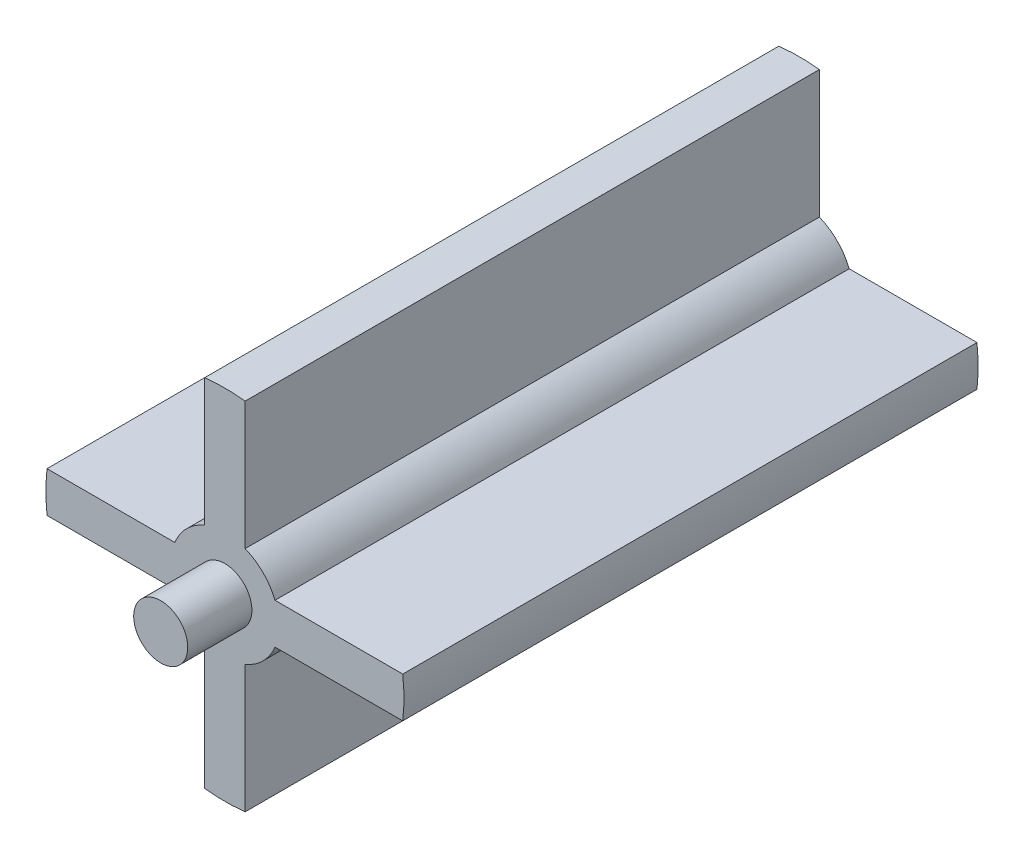
ISO-10303-21;
HEADER;
FILE_DESCRIPTION(('STEP AP214'),'2;1');
FILE_NAME('part.step','',(''),(''),'','','');
FILE_SCHEMA(('AUTOMOTIVE_DESIGN { 1 0 10303 214 1 1 1 1 }'));
ENDSEC;
DATA;
#1=APPLICATION_CONTEXT('core data for automotive mechanical design processes');
#2=APPLICATION_PROTOCOL_DEFINITION('international standard','automotive_design',2000,#1);
#3=PRODUCT_CONTEXT('',#1,'mechanical');
#4=PRODUCT('Part','Part','',(#3));
#5=PRODUCT_RELATED_PRODUCT_CATEGORY('part','',(#4));
#6=PRODUCT_DEFINITION_FORMATION('','',#4);
#7=PRODUCT_DEFINITION_CONTEXT('part definition',#1,'design');
#8=PRODUCT_DEFINITION('design','',#6,#7);
#9=PRODUCT_DEFINITION_SHAPE('','',#8);
#10=(LENGTH_UNIT() NAMED_UNIT(*) SI_UNIT(.MILLI.,.METRE.));
#11=(NAMED_UNIT(*) PLANE_ANGLE_UNIT() SI_UNIT($,.RADIAN.));
#12=(NAMED_UNIT(*) SI_UNIT($,.STERADIAN.) SOLID_ANGLE_UNIT());
#13=UNCERTAINTY_MEASURE_WITH_UNIT(LENGTH_MEASURE(1.E-05),#10,'distance_accuracy_value','');
#14=(GEOMETRIC_REPRESENTATION_CONTEXT(3) GLOBAL_UNCERTAINTY_ASSIGNED_CONTEXT((#13)) GLOBAL_UNIT_ASSIGNED_CONTEXT((#10,
#11,#12)) REPRESENTATION_CONTEXT('',''));
#15=CARTESIAN_POINT('',(0.,0.,0.));
#16=DIRECTION('',(0.,0.,1.));
#17=DIRECTION('',(1.,0.,0.));
#18=AXIS2_PLACEMENT_3D('',#15,#16,#17);
#19=CARTESIAN_POINT('',(9.53294491023637,-9.21867200110799,14.5));
#20=DIRECTION('',(0.,0.,-1.));
#21=DIRECTION('',(-1.,0.,0.));
#22=AXIS2_PLACEMENT_3D('',#19,#20,#21);
#23=CYLINDRICAL_SURFACE('',#22,3.975);
#24=CARTESIAN_POINT('',(9.53294491023637,-9.21867200110799,14.5));
#25=DIRECTION('',(0.,0.,1.));
#26=DIRECTION('',(1.,0.,0.));
#27=AXIS2_PLACEMENT_3D('',#24,#25,#26);
#28=CIRCLE('',#27,3.975);
#29=CARTESIAN_POINT('',(13.5079449102364,-9.21867200110799,14.5));
#30=VERTEX_POINT('',#29);
#31=EDGE_CURVE('E12',#30,#30,#28,.T.);
#32=ORIENTED_EDGE('',*,*,#31,.F.);
#33=EDGE_LOOP('',(#32));
#34=FACE_BOUND('',#33,.T.);
#35=CARTESIAN_POINT('',(9.53294491023637,-9.21867200110799,0.));
#36=DIRECTION('',(0.,0.,1.));
#37=DIRECTION('',(1.,0.,0.));
#38=AXIS2_PLACEMENT_3D('',#35,#36,#37);
#39=CIRCLE('',#38,3.975);
#40=CARTESIAN_POINT('',(13.5079449102364,-9.21867200110799,0.));
#41=VERTEX_POINT('',#40);
#42=EDGE_CURVE('E47',#41,#41,#39,.T.);
#43=ORIENTED_EDGE('',*,*,#42,.T.);
#44=EDGE_LOOP('',(#43));
#45=FACE_BOUND('',#44,.T.);
#46=ADVANCED_FACE('F44',(#34,#45),#23,.T.);
#47=CARTESIAN_POINT('',(9.53294491023637,-9.21867200110799,14.5));
#48=DIRECTION('',(0.,0.,1.));
#49=DIRECTION('',(1.,0.,0.));
#50=AXIS2_PLACEMENT_3D('',#47,#48,#49);
#51=PLANE('',#50);
#52=ORIENTED_EDGE('',*,*,#31,.T.);
#53=EDGE_LOOP('',(#52));
#54=FACE_BOUND('',#53,.T.);
#55=ADVANCED_FACE('F59',(#54),#51,.T.);
#56=CARTESIAN_POINT('',(9.53294491023637,-9.21867200110799,0.));
#57=DIRECTION('',(0.,0.,1.));
#58=DIRECTION('',(1.,0.,0.));
#59=AXIS2_PLACEMENT_3D('',#56,#57,#58);
#60=PLANE('',#59);
#61=ORIENTED_EDGE('',*,*,#42,.F.);
#62=EDGE_LOOP('',(#61));
#63=FACE_BOUND('',#62,.T.);
#64=ADVANCED_FACE('F57',(#63),#60,.F.);
#65=CLOSED_SHELL('',(#46,#55,#64));
#66=MANIFOLD_SOLID_BREP('B2',#65);
#67=CARTESIAN_POINT('',(0.,0.,85.));
#68=DIRECTION('',(0.,0.,-1.));
#69=DIRECTION('',(-1.,0.,0.));
#70=AXIS2_PLACEMENT_3D('',#67,#68,#69);
#71=CYLINDRICAL_SURFACE('',#70,26.5);
#72=DIRECTION('',(0.,0.,-1.));
#73=VECTOR('',#72,1.);
#74=CARTESIAN_POINT('',(26.3296410913632,3.,85.));
#75=LINE('',#74,#73);
#76=CARTESIAN_POINT('',(26.3296410913632,3.,85.));
#77=VERTEX_POINT('',#76);
#78=CARTESIAN_POINT('',(26.3296410913632,3.,0.));
#79=VERTEX_POINT('',#78);
#80=EDGE_CURVE('E225',#77,#79,#75,.T.);
#81=ORIENTED_EDGE('',*,*,#80,.F.);
#82=CARTESIAN_POINT('',(0.,0.,85.));
#83=DIRECTION('',(0.,0.,1.));
#84=DIRECTION('',(1.,0.,0.));
#85=AXIS2_PLACEMENT_3D('',#82,#83,#84);
#86=CIRCLE('',#85,26.5);
#87=CARTESIAN_POINT('',(26.3296410913632,-3.,85.));
#88=VERTEX_POINT('',#87);
#89=EDGE_CURVE('E218',#88,#77,#86,.T.);
#90=ORIENTED_EDGE('',*,*,#89,.F.);
#91=DIRECTION('',(0.,0.,-1.));
#92=VECTOR('',#91,1.);
#93=CARTESIAN_POINT('',(26.3296410913632,-3.,85.));
#94=LINE('',#93,#92);
#95=CARTESIAN_POINT('',(26.3296410913632,-3.,0.));
#96=VERTEX_POINT('',#95);
#97=EDGE_CURVE('E199',#88,#96,#94,.T.);
#98=ORIENTED_EDGE('',*,*,#97,.T.);
#99=CARTESIAN_POINT('',(0.,0.,0.));
#100=DIRECTION('',(0.,0.,1.));
#101=DIRECTION('',(1.,0.,0.));
#102=AXIS2_PLACEMENT_3D('',#99,#100,#101);
#103=CIRCLE('',#102,26.5);
#104=EDGE_CURVE('E88',#96,#79,#103,.T.);
#105=ORIENTED_EDGE('',*,*,#104,.T.);
#106=EDGE_LOOP('',(#81,#90,#98,#105));
#107=FACE_BOUND('',#106,.T.);
#108=ADVANCED_FACE('F85',(#107),#71,.T.);
#109=DIRECTION('',(0.,0.,-1.));
#110=VECTOR('',#109,1.);
#111=CARTESIAN_POINT('',(3.,26.3296410913632,85.));
#112=LINE('',#111,#110);
#113=CARTESIAN_POINT('',(3.,26.3296410913632,85.));
#114=VERTEX_POINT('',#113);
#115=CARTESIAN_POINT('',(3.,26.3296410913632,0.));
#116=VERTEX_POINT('',#115);
#117=EDGE_CURVE('E292',#114,#116,#112,.T.);
#118=ORIENTED_EDGE('',*,*,#117,.T.);
#119=CARTESIAN_POINT('',(-3.,26.3296410913632,0.));
#120=VERTEX_POINT('',#119);
#121=EDGE_CURVE('E227',#116,#120,#103,.T.);
#122=ORIENTED_EDGE('',*,*,#121,.T.);
#123=DIRECTION('',(0.,0.,-1.));
#124=VECTOR('',#123,1.);
#125=CARTESIAN_POINT('',(-3.,26.3296410913632,85.));
#126=LINE('',#125,#124);
#127=CARTESIAN_POINT('',(-3.,26.3296410913632,85.));
#128=VERTEX_POINT('',#127);
#129=EDGE_CURVE('E295',#128,#120,#126,.T.);
#130=ORIENTED_EDGE('',*,*,#129,.F.);
#131=EDGE_CURVE('E93',#114,#128,#86,.T.);
#132=ORIENTED_EDGE('',*,*,#131,.F.);
#133=EDGE_LOOP('',(#118,#122,#130,#132));
#134=FACE_BOUND('',#133,.T.);
#135=ADVANCED_FACE('F382',(#134),#71,.T.);
#136=DIRECTION('',(0.,0.,-1.));
#137=VECTOR('',#136,1.);
#138=CARTESIAN_POINT('',(-26.3296410913632,3.,85.));
#139=LINE('',#138,#137);
#140=CARTESIAN_POINT('',(-26.3296410913632,3.,85.));
#141=VERTEX_POINT('',#140);
#142=CARTESIAN_POINT('',(-26.3296410913632,3.,0.));
#143=VERTEX_POINT('',#142);
#144=EDGE_CURVE('E251',#141,#143,#139,.T.);
#145=ORIENTED_EDGE('',*,*,#144,.T.);
#146=CARTESIAN_POINT('',(-26.3296410913632,-3.,0.));
#147=VERTEX_POINT('',#146);
#148=EDGE_CURVE('E231',#143,#147,#103,.T.);
#149=ORIENTED_EDGE('',*,*,#148,.T.);
#150=DIRECTION('',(0.,0.,-1.));
#151=VECTOR('',#150,1.);
#152=CARTESIAN_POINT('',(-26.3296410913632,-3.,85.));
#153=LINE('',#152,#151);
#154=CARTESIAN_POINT('',(-26.3296410913632,-3.,85.));
#155=VERTEX_POINT('',#154);
#156=EDGE_CURVE('E253',#155,#147,#153,.T.);
#157=ORIENTED_EDGE('',*,*,#156,.F.);
#158=EDGE_CURVE('E229',#141,#155,#86,.T.);
#159=ORIENTED_EDGE('',*,*,#158,.F.);
#160=EDGE_LOOP('',(#145,#149,#157,#159));
#161=FACE_BOUND('',#160,.T.);
#162=ADVANCED_FACE('F249',(#161),#71,.T.);
#163=DIRECTION('',(0.,0.,-1.));
#164=VECTOR('',#163,1.);
#165=CARTESIAN_POINT('',(-3.,-26.3296410913632,85.));
#166=LINE('',#165,#164);
#167=CARTESIAN_POINT('',(-3.,-26.3296410913632,85.));
#168=VERTEX_POINT('',#167);
#169=CARTESIAN_POINT('',(-3.,-26.3296410913632,0.));
#170=VERTEX_POINT('',#169);
#171=EDGE_CURVE('E267',#168,#170,#166,.T.);
#172=ORIENTED_EDGE('',*,*,#171,.T.);
#173=CARTESIAN_POINT('',(2.99999999999999,-26.3296410913632,0.));
#174=VERTEX_POINT('',#173);
#175=EDGE_CURVE('E317',#170,#174,#103,.T.);
#176=ORIENTED_EDGE('',*,*,#175,.T.);
#177=DIRECTION('',(0.,0.,-1.));
#178=VECTOR('',#177,1.);
#179=CARTESIAN_POINT('',(2.99999999999999,-26.3296410913632,85.));
#180=LINE('',#179,#178);
#181=CARTESIAN_POINT('',(2.99999999999999,-26.3296410913632,85.));
#182=VERTEX_POINT('',#181);
#183=EDGE_CURVE('E270',#182,#174,#180,.T.);
#184=ORIENTED_EDGE('',*,*,#183,.F.);
#185=EDGE_CURVE('E226',#168,#182,#86,.T.);
#186=ORIENTED_EDGE('',*,*,#185,.F.);
#187=EDGE_LOOP('',(#172,#176,#184,#186));
#188=FACE_BOUND('',#187,.T.);
#189=ADVANCED_FACE('F322',(#188),#71,.T.);
#190=CARTESIAN_POINT('',(0.,0.,85.));
#191=DIRECTION('',(0.,0.,1.));
#192=DIRECTION('',(1.,0.,0.));
#193=AXIS2_PLACEMENT_3D('',#190,#191,#192);
#194=PLANE('',#193);
#195=CARTESIAN_POINT('',(0.,0.,85.));
#196=DIRECTION('',(0.,0.,1.));
#197=DIRECTION('',(1.,0.,0.));
#198=AXIS2_PLACEMENT_3D('',#195,#196,#197);
#199=CIRCLE('',#198,4.);
#200=CARTESIAN_POINT('',(4.,0.,85.));
#201=VERTEX_POINT('',#200);
#202=EDGE_CURVE('E42',#201,#201,#199,.T.);
#203=ORIENTED_EDGE('',*,*,#202,.F.);
#204=EDGE_LOOP('',(#203));
#205=FACE_BOUND('',#204,.T.);
#206=ORIENTED_EDGE('',*,*,#89,.T.);
#207=DIRECTION('',(1.,0.,0.));
#208=VECTOR('',#207,1.);
#209=CARTESIAN_POINT('',(26.3296410913632,3.,85.));
#210=LINE('',#209,#208);
#211=CARTESIAN_POINT('',(7.41619848709566,3.,85.));
#212=VERTEX_POINT('',#211);
#213=EDGE_CURVE('E212',#212,#77,#210,.T.);
#214=ORIENTED_EDGE('',*,*,#213,.F.);
#215=CARTESIAN_POINT('',(0.,0.,85.));
#216=DIRECTION('',(0.,0.,-1.));
#217=DIRECTION('',(-1.,0.,0.));
#218=AXIS2_PLACEMENT_3D('',#215,#216,#217);
#219=CIRCLE('',#218,8.);
#220=CARTESIAN_POINT('',(3.,7.41619848709566,85.));
#221=VERTEX_POINT('',#220);
#222=EDGE_CURVE('E360',#221,#212,#219,.T.);
#223=ORIENTED_EDGE('',*,*,#222,.F.);
#224=DIRECTION('',(0.,-1.,0.));
#225=VECTOR('',#224,1.);
#226=CARTESIAN_POINT('',(3.,7.41619848709566,85.));
#227=LINE('',#226,#225);
#228=EDGE_CURVE('E357',#114,#221,#227,.T.);
#229=ORIENTED_EDGE('',*,*,#228,.F.);
#230=ORIENTED_EDGE('',*,*,#131,.T.);
#231=DIRECTION('',(0.,1.,0.));
#232=VECTOR('',#231,1.);
#233=CARTESIAN_POINT('',(-3.,26.3296410913632,85.));
#234=LINE('',#233,#232);
#235=CARTESIAN_POINT('',(-3.,7.41619848709566,85.));
#236=VERTEX_POINT('',#235);
#237=EDGE_CURVE('E355',#236,#128,#234,.T.);
#238=ORIENTED_EDGE('',*,*,#237,.F.);
#239=CARTESIAN_POINT('',(0.,0.,85.));
#240=DIRECTION('',(0.,0.,-1.));
#241=DIRECTION('',(-1.,0.,0.));
#242=AXIS2_PLACEMENT_3D('',#239,#240,#241);
#243=CIRCLE('',#242,8.);
#244=CARTESIAN_POINT('',(-7.41619848709566,3.,85.));
#245=VERTEX_POINT('',#244);
#246=EDGE_CURVE('E353',#245,#236,#243,.T.);
#247=ORIENTED_EDGE('',*,*,#246,.F.);
#248=DIRECTION('',(1.,0.,0.));
#249=VECTOR('',#248,1.);
#250=CARTESIAN_POINT('',(-7.41619848709566,3.,85.));
#251=LINE('',#250,#249);
#252=EDGE_CURVE('E245',#141,#245,#251,.T.);
#253=ORIENTED_EDGE('',*,*,#252,.F.);
#254=ORIENTED_EDGE('',*,*,#158,.T.);
#255=DIRECTION('',(-1.,0.,0.));
#256=VECTOR('',#255,1.);
#257=CARTESIAN_POINT('',(-26.3296410913632,-3.,85.));
#258=LINE('',#257,#256);
#259=CARTESIAN_POINT('',(-7.41619848709566,-3.,85.));
#260=VERTEX_POINT('',#259);
#261=EDGE_CURVE('E242',#260,#155,#258,.T.);
#262=ORIENTED_EDGE('',*,*,#261,.F.);
#263=CARTESIAN_POINT('',(0.,0.,85.));
#264=DIRECTION('',(0.,0.,-1.));
#265=DIRECTION('',(-1.,0.,0.));
#266=AXIS2_PLACEMENT_3D('',#263,#264,#265);
#267=CIRCLE('',#266,8.);
#268=CARTESIAN_POINT('',(-3.,-7.41619848709566,85.));
#269=VERTEX_POINT('',#268);
#270=EDGE_CURVE('E345',#269,#260,#267,.T.);
#271=ORIENTED_EDGE('',*,*,#270,.F.);
#272=DIRECTION('',(0.,1.,0.));
#273=VECTOR('',#272,1.);
#274=CARTESIAN_POINT('',(-3.,-26.3296410913632,85.));
#275=LINE('',#274,#273);
#276=EDGE_CURVE('E344',#168,#269,#275,.T.);
#277=ORIENTED_EDGE('',*,*,#276,.F.);
#278=ORIENTED_EDGE('',*,*,#185,.T.);
#279=DIRECTION('',(0.,-1.,0.));
#280=VECTOR('',#279,1.);
#281=CARTESIAN_POINT('',(3.,-7.41619848709566,85.));
#282=LINE('',#281,#280);
#283=CARTESIAN_POINT('',(3.,-7.41619848709566,85.));
#284=VERTEX_POINT('',#283);
#285=EDGE_CURVE('E346',#284,#182,#282,.T.);
#286=ORIENTED_EDGE('',*,*,#285,.F.);
#287=CARTESIAN_POINT('',(0.,0.,85.));
#288=DIRECTION('',(0.,0.,-1.));
#289=DIRECTION('',(-1.,0.,0.));
#290=AXIS2_PLACEMENT_3D('',#287,#288,#289);
#291=CIRCLE('',#290,8.);
#292=CARTESIAN_POINT('',(7.41619848709566,-3.,85.));
#293=VERTEX_POINT('',#292);
#294=EDGE_CURVE('E221',#293,#284,#291,.T.);
#295=ORIENTED_EDGE('',*,*,#294,.F.);
#296=DIRECTION('',(-1.,0.,0.));
#297=VECTOR('',#296,1.);
#298=CARTESIAN_POINT('',(7.41619848709566,-3.,85.));
#299=LINE('',#298,#297);
#300=EDGE_CURVE('E203',#88,#293,#299,.T.);
#301=ORIENTED_EDGE('',*,*,#300,.F.);
#302=EDGE_LOOP('',(#206,#214,#223,#229,#230,#238,#247,#253,#254,#262,#271,#277,#278,#286,#295,#301));
#303=FACE_BOUND('',#302,.T.);
#304=ADVANCED_FACE('F216',(#205,#303),#194,.T.);
#305=CARTESIAN_POINT('',(0.,0.,0.));
#306=DIRECTION('',(0.,0.,1.));
#307=DIRECTION('',(1.,0.,0.));
#308=AXIS2_PLACEMENT_3D('',#305,#306,#307);
#309=PLANE('',#308);
#310=CARTESIAN_POINT('',(0.,0.,0.));
#311=DIRECTION('',(0.,0.,-1.));
#312=DIRECTION('',(-1.,0.,0.));
#313=AXIS2_PLACEMENT_3D('',#310,#311,#312);
#314=CIRCLE('',#313,4.);
#315=CARTESIAN_POINT('',(-4.,0.,0.));
#316=VERTEX_POINT('',#315);
#317=EDGE_CURVE('E277',#316,#316,#314,.T.);
#318=ORIENTED_EDGE('',*,*,#317,.F.);
#319=EDGE_LOOP('',(#318));
#320=FACE_BOUND('',#319,.T.);
#321=DIRECTION('',(1.,0.,0.));
#322=VECTOR('',#321,1.);
#323=CARTESIAN_POINT('',(26.3296410913632,3.,0.));
#324=LINE('',#323,#322);
#325=CARTESIAN_POINT('',(7.41619848709566,3.,0.));
#326=VERTEX_POINT('',#325);
#327=EDGE_CURVE('E222',#326,#79,#324,.T.);
#328=ORIENTED_EDGE('',*,*,#327,.T.);
#329=ORIENTED_EDGE('',*,*,#104,.F.);
#330=DIRECTION('',(-1.,0.,0.));
#331=VECTOR('',#330,1.);
#332=CARTESIAN_POINT('',(7.41619848709566,-3.,0.));
#333=LINE('',#332,#331);
#334=CARTESIAN_POINT('',(7.41619848709566,-3.,0.));
#335=VERTEX_POINT('',#334);
#336=EDGE_CURVE('E206',#96,#335,#333,.T.);
#337=ORIENTED_EDGE('',*,*,#336,.T.);
#338=CARTESIAN_POINT('',(0.,0.,0.));
#339=DIRECTION('',(0.,0.,-1.));
#340=DIRECTION('',(-1.,0.,0.));
#341=AXIS2_PLACEMENT_3D('',#338,#339,#340);
#342=CIRCLE('',#341,8.);
#343=CARTESIAN_POINT('',(3.,-7.41619848709566,0.));
#344=VERTEX_POINT('',#343);
#345=EDGE_CURVE('E331',#335,#344,#342,.T.);
#346=ORIENTED_EDGE('',*,*,#345,.T.);
#347=DIRECTION('',(0.,-1.,0.));
#348=VECTOR('',#347,1.);
#349=CARTESIAN_POINT('',(3.,-7.41619848709566,0.));
#350=LINE('',#349,#348);
#351=EDGE_CURVE('E330',#344,#174,#350,.T.);
#352=ORIENTED_EDGE('',*,*,#351,.T.);
#353=ORIENTED_EDGE('',*,*,#175,.F.);
#354=DIRECTION('',(0.,1.,0.));
#355=VECTOR('',#354,1.);
#356=CARTESIAN_POINT('',(-3.,-26.3296410913632,0.));
#357=LINE('',#356,#355);
#358=CARTESIAN_POINT('',(-3.,-7.41619848709566,0.));
#359=VERTEX_POINT('',#358);
#360=EDGE_CURVE('E327',#170,#359,#357,.T.);
#361=ORIENTED_EDGE('',*,*,#360,.T.);
#362=CARTESIAN_POINT('',(0.,0.,0.));
#363=DIRECTION('',(0.,0.,-1.));
#364=DIRECTION('',(-1.,0.,0.));
#365=AXIS2_PLACEMENT_3D('',#362,#363,#364);
#366=CIRCLE('',#365,8.);
#367=CARTESIAN_POINT('',(-7.41619848709566,-3.,0.));
#368=VERTEX_POINT('',#367);
#369=EDGE_CURVE('E310',#359,#368,#366,.T.);
#370=ORIENTED_EDGE('',*,*,#369,.T.);
#371=DIRECTION('',(-1.,0.,0.));
#372=VECTOR('',#371,1.);
#373=CARTESIAN_POINT('',(-26.3296410913632,-3.,0.));
#374=LINE('',#373,#372);
#375=EDGE_CURVE('E306',#368,#147,#374,.T.);
#376=ORIENTED_EDGE('',*,*,#375,.T.);
#377=ORIENTED_EDGE('',*,*,#148,.F.);
#378=DIRECTION('',(1.,0.,0.));
#379=VECTOR('',#378,1.);
#380=CARTESIAN_POINT('',(-7.41619848709566,3.,0.));
#381=LINE('',#380,#379);
#382=CARTESIAN_POINT('',(-7.41619848709566,3.,0.));
#383=VERTEX_POINT('',#382);
#384=EDGE_CURVE('E301',#143,#383,#381,.T.);
#385=ORIENTED_EDGE('',*,*,#384,.T.);
#386=CARTESIAN_POINT('',(0.,0.,0.));
#387=DIRECTION('',(0.,0.,-1.));
#388=DIRECTION('',(-1.,0.,0.));
#389=AXIS2_PLACEMENT_3D('',#386,#387,#388);
#390=CIRCLE('',#389,8.);
#391=CARTESIAN_POINT('',(-3.,7.41619848709566,0.));
#392=VERTEX_POINT('',#391);
#393=EDGE_CURVE('E109',#383,#392,#390,.T.);
#394=ORIENTED_EDGE('',*,*,#393,.T.);
#395=DIRECTION('',(0.,1.,0.));
#396=VECTOR('',#395,1.);
#397=CARTESIAN_POINT('',(-3.,26.3296410913632,0.));
#398=LINE('',#397,#396);
#399=EDGE_CURVE('E308',#392,#120,#398,.T.);
#400=ORIENTED_EDGE('',*,*,#399,.T.);
#401=ORIENTED_EDGE('',*,*,#121,.F.);
#402=DIRECTION('',(0.,-1.,0.));
#403=VECTOR('',#402,1.);
#404=CARTESIAN_POINT('',(3.,7.41619848709566,0.));
#405=LINE('',#404,#403);
#406=CARTESIAN_POINT('',(3.,7.41619848709566,0.));
#407=VERTEX_POINT('',#406);
#408=EDGE_CURVE('E315',#116,#407,#405,.T.);
#409=ORIENTED_EDGE('',*,*,#408,.T.);
#410=CARTESIAN_POINT('',(0.,0.,0.));
#411=DIRECTION('',(0.,0.,-1.));
#412=DIRECTION('',(-1.,0.,0.));
#413=AXIS2_PLACEMENT_3D('',#410,#411,#412);
#414=CIRCLE('',#413,8.);
#415=EDGE_CURVE('E101',#407,#326,#414,.T.);
#416=ORIENTED_EDGE('',*,*,#415,.T.);
#417=EDGE_LOOP('',(#328,#329,#337,#346,#352,#353,#361,#370,#376,#377,#385,#394,#400,#401,#409,#416));
#418=FACE_BOUND('',#417,.T.);
#419=ADVANCED_FACE('F304',(#320,#418),#309,.F.);
#420=CARTESIAN_POINT('',(0.,0.,5.));
#421=DIRECTION('',(0.,0.,-1.));
#422=DIRECTION('',(-1.,0.,0.));
#423=AXIS2_PLACEMENT_3D('',#420,#421,#422);
#424=CYLINDRICAL_SURFACE('',#423,4.);
#425=CARTESIAN_POINT('',(0.,0.,5.));
#426=DIRECTION('',(0.,0.,-1.));
#427=DIRECTION('',(-1.,0.,0.));
#428=AXIS2_PLACEMENT_3D('',#425,#426,#427);
#429=CIRCLE('',#428,4.);
#430=CARTESIAN_POINT('',(-4.,0.,5.));
#431=VERTEX_POINT('',#430);
#432=EDGE_CURVE('E275',#431,#431,#429,.T.);
#433=ORIENTED_EDGE('',*,*,#432,.F.);
#434=EDGE_LOOP('',(#433));
#435=FACE_BOUND('',#434,.T.);
#436=ORIENTED_EDGE('',*,*,#317,.T.);
#437=EDGE_LOOP('',(#436));
#438=FACE_BOUND('',#437,.T.);
#439=ADVANCED_FACE('F414',(#435,#438),#424,.F.);
#440=CARTESIAN_POINT('',(0.,0.,5.));
#441=DIRECTION('',(0.,0.,-1.));
#442=DIRECTION('',(-1.,0.,0.));
#443=AXIS2_PLACEMENT_3D('',#440,#441,#442);
#444=PLANE('',#443);
#445=ORIENTED_EDGE('',*,*,#432,.T.);
#446=EDGE_LOOP('',(#445));
#447=FACE_BOUND('',#446,.T.);
#448=ADVANCED_FACE('F379',(#447),#444,.T.);
#449=CARTESIAN_POINT('',(7.41619848709566,-3.,85.));
#450=DIRECTION('',(0.,-1.,0.));
#451=DIRECTION('',(1.,0.,0.));
#452=AXIS2_PLACEMENT_3D('',#449,#450,#451);
#453=PLANE('',#452);
#454=ORIENTED_EDGE('',*,*,#336,.F.);
#455=ORIENTED_EDGE('',*,*,#97,.F.);
#456=ORIENTED_EDGE('',*,*,#300,.T.);
#457=DIRECTION('',(0.,0.,-1.));
#458=VECTOR('',#457,1.);
#459=CARTESIAN_POINT('',(7.41619848709566,-3.,85.));
#460=LINE('',#459,#458);
#461=EDGE_CURVE('E211',#293,#335,#460,.T.);
#462=ORIENTED_EDGE('',*,*,#461,.T.);
#463=EDGE_LOOP('',(#454,#455,#456,#462));
#464=FACE_BOUND('',#463,.T.);
#465=ADVANCED_FACE('F201',(#464),#453,.T.);
#466=CARTESIAN_POINT('',(0.,0.,85.));
#467=DIRECTION('',(0.,0.,-1.));
#468=DIRECTION('',(-1.,0.,0.));
#469=AXIS2_PLACEMENT_3D('',#466,#467,#468);
#470=CYLINDRICAL_SURFACE('',#469,8.);
#471=ORIENTED_EDGE('',*,*,#345,.F.);
#472=ORIENTED_EDGE('',*,*,#461,.F.);
#473=ORIENTED_EDGE('',*,*,#294,.T.);
#474=DIRECTION('',(0.,0.,-1.));
#475=VECTOR('',#474,1.);
#476=CARTESIAN_POINT('',(3.,-7.41619848709566,85.));
#477=LINE('',#476,#475);
#478=EDGE_CURVE('E272',#284,#344,#477,.T.);
#479=ORIENTED_EDGE('',*,*,#478,.T.);
#480=EDGE_LOOP('',(#471,#472,#473,#479));
#481=FACE_BOUND('',#480,.T.);
#482=ADVANCED_FACE('F371',(#481),#470,.T.);
#483=CARTESIAN_POINT('',(3.,-7.41619848709566,85.));
#484=DIRECTION('',(1.,0.,0.));
#485=DIRECTION('',(0.,1.,0.));
#486=AXIS2_PLACEMENT_3D('',#483,#484,#485);
#487=PLANE('',#486);
#488=ORIENTED_EDGE('',*,*,#351,.F.);
#489=ORIENTED_EDGE('',*,*,#478,.F.);
#490=ORIENTED_EDGE('',*,*,#285,.T.);
#491=ORIENTED_EDGE('',*,*,#183,.T.);
#492=EDGE_LOOP('',(#488,#489,#490,#491));
#493=FACE_BOUND('',#492,.T.);
#494=ADVANCED_FACE('F369',(#493),#487,.T.);
#495=CARTESIAN_POINT('',(-3.,-26.3296410913632,85.));
#496=DIRECTION('',(-1.,0.,0.));
#497=DIRECTION('',(0.,0.,1.));
#498=AXIS2_PLACEMENT_3D('',#495,#496,#497);
#499=PLANE('',#498);
#500=ORIENTED_EDGE('',*,*,#360,.F.);
#501=ORIENTED_EDGE('',*,*,#171,.F.);
#502=ORIENTED_EDGE('',*,*,#276,.T.);
#503=DIRECTION('',(0.,0.,-1.));
#504=VECTOR('',#503,1.);
#505=CARTESIAN_POINT('',(-3.,-7.41619848709566,85.));
#506=LINE('',#505,#504);
#507=EDGE_CURVE('E261',#269,#359,#506,.T.);
#508=ORIENTED_EDGE('',*,*,#507,.T.);
#509=EDGE_LOOP('',(#500,#501,#502,#508));
#510=FACE_BOUND('',#509,.T.);
#511=ADVANCED_FACE('F342',(#510),#499,.T.);
#512=CARTESIAN_POINT('',(0.,0.,85.));
#513=DIRECTION('',(0.,0.,-1.));
#514=DIRECTION('',(-1.,0.,0.));
#515=AXIS2_PLACEMENT_3D('',#512,#513,#514);
#516=CYLINDRICAL_SURFACE('',#515,8.);
#517=ORIENTED_EDGE('',*,*,#369,.F.);
#518=ORIENTED_EDGE('',*,*,#507,.F.);
#519=ORIENTED_EDGE('',*,*,#270,.T.);
#520=DIRECTION('',(0.,0.,-1.));
#521=VECTOR('',#520,1.);
#522=CARTESIAN_POINT('',(-7.41619848709566,-3.,85.));
#523=LINE('',#522,#521);
#524=EDGE_CURVE('E257',#260,#368,#523,.T.);
#525=ORIENTED_EDGE('',*,*,#524,.T.);
#526=EDGE_LOOP('',(#517,#518,#519,#525));
#527=FACE_BOUND('',#526,.T.);
#528=ADVANCED_FACE('F338',(#527),#516,.T.);
#529=CARTESIAN_POINT('',(-26.3296410913632,-3.,85.));
#530=DIRECTION('',(0.,-1.,0.));
#531=DIRECTION('',(1.,0.,0.));
#532=AXIS2_PLACEMENT_3D('',#529,#530,#531);
#533=PLANE('',#532);
#534=ORIENTED_EDGE('',*,*,#375,.F.);
#535=ORIENTED_EDGE('',*,*,#524,.F.);
#536=ORIENTED_EDGE('',*,*,#261,.T.);
#537=ORIENTED_EDGE('',*,*,#156,.T.);
#538=EDGE_LOOP('',(#534,#535,#536,#537));
#539=FACE_BOUND('',#538,.T.);
#540=ADVANCED_FACE('F485',(#539),#533,.T.);
#541=CARTESIAN_POINT('',(-7.41619848709566,3.,85.));
#542=DIRECTION('',(0.,1.,0.));
#543=DIRECTION('',(0.,0.,1.));
#544=AXIS2_PLACEMENT_3D('',#541,#542,#543);
#545=PLANE('',#544);
#546=ORIENTED_EDGE('',*,*,#384,.F.);
#547=ORIENTED_EDGE('',*,*,#144,.F.);
#548=ORIENTED_EDGE('',*,*,#252,.T.);
#549=DIRECTION('',(0.,0.,-1.));
#550=VECTOR('',#549,1.);
#551=CARTESIAN_POINT('',(-7.41619848709566,3.,85.));
#552=LINE('',#551,#550);
#553=EDGE_CURVE('E259',#245,#383,#552,.T.);
#554=ORIENTED_EDGE('',*,*,#553,.T.);
#555=EDGE_LOOP('',(#546,#547,#548,#554));
#556=FACE_BOUND('',#555,.T.);
#557=ADVANCED_FACE('F300',(#556),#545,.T.);
#558=CARTESIAN_POINT('',(0.,0.,85.));
#559=DIRECTION('',(0.,0.,-1.));
#560=DIRECTION('',(-1.,0.,0.));
#561=AXIS2_PLACEMENT_3D('',#558,#559,#560);
#562=CYLINDRICAL_SURFACE('',#561,8.);
#563=ORIENTED_EDGE('',*,*,#393,.F.);
#564=ORIENTED_EDGE('',*,*,#553,.F.);
#565=ORIENTED_EDGE('',*,*,#246,.T.);
#566=DIRECTION('',(0.,0.,-1.));
#567=VECTOR('',#566,1.);
#568=CARTESIAN_POINT('',(-3.,7.41619848709566,85.));
#569=LINE('',#568,#567);
#570=EDGE_CURVE('E297',#236,#392,#569,.T.);
#571=ORIENTED_EDGE('',*,*,#570,.T.);
#572=EDGE_LOOP('',(#563,#564,#565,#571));
#573=FACE_BOUND('',#572,.T.);
#574=ADVANCED_FACE('F479',(#573),#562,.T.);
#575=CARTESIAN_POINT('',(-3.,26.3296410913632,85.));
#576=DIRECTION('',(-1.,0.,0.));
#577=DIRECTION('',(0.,-1.,0.));
#578=AXIS2_PLACEMENT_3D('',#575,#576,#577);
#579=PLANE('',#578);
#580=ORIENTED_EDGE('',*,*,#399,.F.);
#581=ORIENTED_EDGE('',*,*,#570,.F.);
#582=ORIENTED_EDGE('',*,*,#237,.T.);
#583=ORIENTED_EDGE('',*,*,#129,.T.);
#584=EDGE_LOOP('',(#580,#581,#582,#583));
#585=FACE_BOUND('',#584,.T.);
#586=ADVANCED_FACE('F472',(#585),#579,.T.);
#587=CARTESIAN_POINT('',(26.3296410913632,3.,85.));
#588=DIRECTION('',(0.,1.,0.));
#589=DIRECTION('',(0.,0.,1.));
#590=AXIS2_PLACEMENT_3D('',#587,#588,#589);
#591=PLANE('',#590);
#592=ORIENTED_EDGE('',*,*,#327,.F.);
#593=DIRECTION('',(0.,0.,-1.));
#594=VECTOR('',#593,1.);
#595=CARTESIAN_POINT('',(7.41619848709566,3.,85.));
#596=LINE('',#595,#594);
#597=EDGE_CURVE('E281',#212,#326,#596,.T.);
#598=ORIENTED_EDGE('',*,*,#597,.F.);
#599=ORIENTED_EDGE('',*,*,#213,.T.);
#600=ORIENTED_EDGE('',*,*,#80,.T.);
#601=EDGE_LOOP('',(#592,#598,#599,#600));
#602=FACE_BOUND('',#601,.T.);
#603=ADVANCED_FACE('F468',(#602),#591,.T.);
#604=CARTESIAN_POINT('',(0.,0.,85.));
#605=DIRECTION('',(0.,0.,-1.));
#606=DIRECTION('',(-1.,0.,0.));
#607=AXIS2_PLACEMENT_3D('',#604,#605,#606);
#608=CYLINDRICAL_SURFACE('',#607,8.);
#609=ORIENTED_EDGE('',*,*,#415,.F.);
#610=DIRECTION('',(0.,0.,-1.));
#611=VECTOR('',#610,1.);
#612=CARTESIAN_POINT('',(3.,7.41619848709566,85.));
#613=LINE('',#612,#611);
#614=EDGE_CURVE('E286',#221,#407,#613,.T.);
#615=ORIENTED_EDGE('',*,*,#614,.F.);
#616=ORIENTED_EDGE('',*,*,#222,.T.);
#617=ORIENTED_EDGE('',*,*,#597,.T.);
#618=EDGE_LOOP('',(#609,#615,#616,#617));
#619=FACE_BOUND('',#618,.T.);
#620=ADVANCED_FACE('F471',(#619),#608,.T.);
#621=CARTESIAN_POINT('',(3.,7.41619848709566,85.));
#622=DIRECTION('',(1.,0.,0.));
#623=DIRECTION('',(0.,0.,-1.));
#624=AXIS2_PLACEMENT_3D('',#621,#622,#623);
#625=PLANE('',#624);
#626=ORIENTED_EDGE('',*,*,#408,.F.);
#627=ORIENTED_EDGE('',*,*,#117,.F.);
#628=ORIENTED_EDGE('',*,*,#228,.T.);
#629=ORIENTED_EDGE('',*,*,#614,.T.);
#630=EDGE_LOOP('',(#626,#627,#628,#629));
#631=FACE_BOUND('',#630,.T.);
#632=ADVANCED_FACE('F444',(#631),#625,.T.);
#633=CARTESIAN_POINT('',(0.,0.,94.5));
#634=DIRECTION('',(0.,0.,-1.));
#635=DIRECTION('',(-1.,0.,0.));
#636=AXIS2_PLACEMENT_3D('',#633,#634,#635);
#637=CYLINDRICAL_SURFACE('',#636,4.);
#638=CARTESIAN_POINT('',(0.,0.,94.5));
#639=DIRECTION('',(0.,0.,1.));
#640=DIRECTION('',(1.,0.,0.));
#641=AXIS2_PLACEMENT_3D('',#638,#639,#640);
#642=CIRCLE('',#641,4.);
#643=CARTESIAN_POINT('',(4.,0.,94.5));
#644=VERTEX_POINT('',#643);
#645=EDGE_CURVE('E363',#644,#644,#642,.T.);
#646=ORIENTED_EDGE('',*,*,#645,.F.);
#647=EDGE_LOOP('',(#646));
#648=FACE_BOUND('',#647,.T.);
#649=ORIENTED_EDGE('',*,*,#202,.T.);
#650=EDGE_LOOP('',(#649));
#651=FACE_BOUND('',#650,.T.);
#652=ADVANCED_FACE('F449',(#648,#651),#637,.T.);
#653=CARTESIAN_POINT('',(0.,0.,94.5));
#654=DIRECTION('',(0.,0.,1.));
#655=DIRECTION('',(1.,0.,0.));
#656=AXIS2_PLACEMENT_3D('',#653,#654,#655);
#657=PLANE('',#656);
#658=ORIENTED_EDGE('',*,*,#645,.T.);
#659=EDGE_LOOP('',(#658));
#660=FACE_BOUND('',#659,.T.);
#661=ADVANCED_FACE('F454',(#660),#657,.T.);
#662=CLOSED_SHELL('',(#108,#135,#162,#189,#304,#419,#439,#448,#465,#482,#494,#511,#528,#540,
#557,#574,#586,#603,#620,#632,#652,#661));
#663=MANIFOLD_SOLID_BREP('B7',#662);
#664=ADVANCED_BREP_SHAPE_REPRESENTATION('',(#18,#66,#663),#14);
#665=SHAPE_DEFINITION_REPRESENTATION(#9,#664);
ENDSEC;
END-ISO-10303-21;
